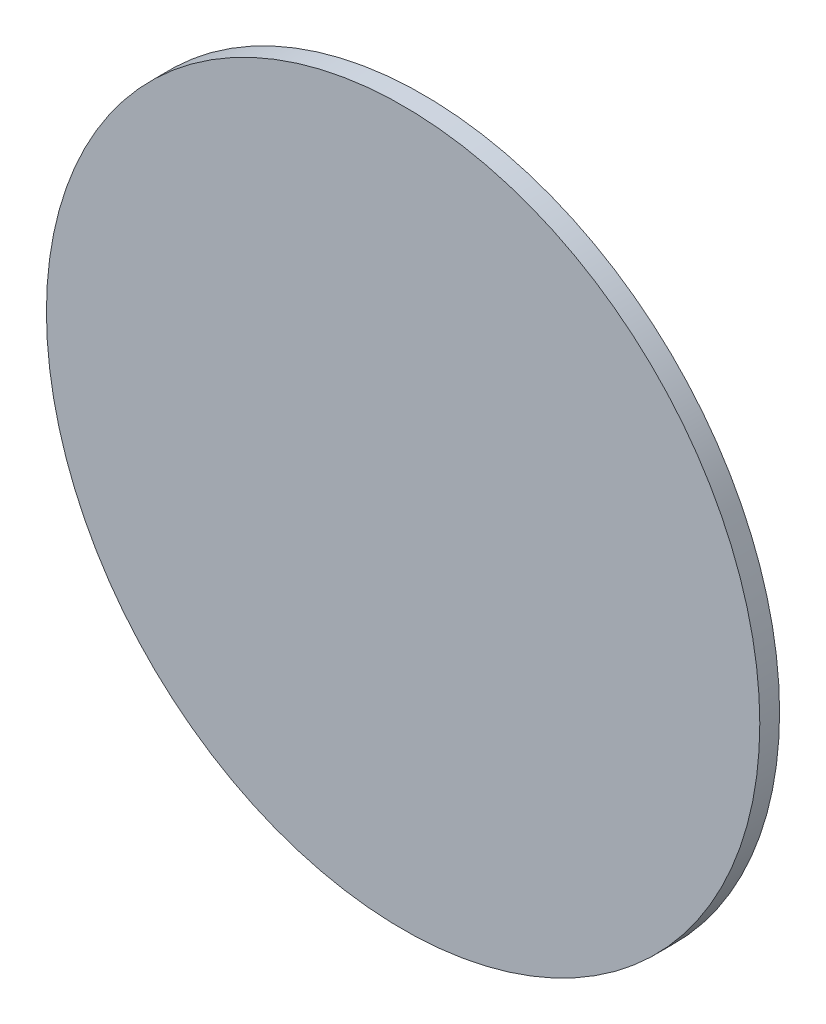
ISO-10303-21;
HEADER;
FILE_DESCRIPTION(('STEP AP214'),'2;1');
FILE_NAME('part.step','',(''),(''),'','','');
FILE_SCHEMA(('AUTOMOTIVE_DESIGN { 1 0 10303 214 1 1 1 1 }'));
ENDSEC;
DATA;
#1=APPLICATION_CONTEXT('core data for automotive mechanical design processes');
#2=APPLICATION_PROTOCOL_DEFINITION('international standard','automotive_design',2000,#1);
#3=PRODUCT_CONTEXT('',#1,'mechanical');
#4=PRODUCT('Part','Part','',(#3));
#5=PRODUCT_RELATED_PRODUCT_CATEGORY('part','',(#4));
#6=PRODUCT_DEFINITION_FORMATION('','',#4);
#7=PRODUCT_DEFINITION_CONTEXT('part definition',#1,'design');
#8=PRODUCT_DEFINITION('design','',#6,#7);
#9=PRODUCT_DEFINITION_SHAPE('','',#8);
#10=(LENGTH_UNIT() NAMED_UNIT(*) SI_UNIT(.MILLI.,.METRE.));
#11=(NAMED_UNIT(*) PLANE_ANGLE_UNIT() SI_UNIT($,.RADIAN.));
#12=(NAMED_UNIT(*) SI_UNIT($,.STERADIAN.) SOLID_ANGLE_UNIT());
#13=UNCERTAINTY_MEASURE_WITH_UNIT(LENGTH_MEASURE(1.E-05),#10,'distance_accuracy_value','');
#14=(GEOMETRIC_REPRESENTATION_CONTEXT(3) GLOBAL_UNCERTAINTY_ASSIGNED_CONTEXT((#13)) GLOBAL_UNIT_ASSIGNED_CONTEXT((#10,
#11,#12)) REPRESENTATION_CONTEXT('',''));
#15=CARTESIAN_POINT('',(0.,0.,0.));
#16=DIRECTION('',(0.,0.,1.));
#17=DIRECTION('',(1.,0.,0.));
#18=AXIS2_PLACEMENT_3D('',#15,#16,#17);
#19=CARTESIAN_POINT('',(0.,0.,7.4));
#20=DIRECTION('',(0.,0.,-1.));
#21=DIRECTION('',(-1.,0.,0.));
#22=AXIS2_PLACEMENT_3D('',#19,#20,#21);
#23=CYLINDRICAL_SURFACE('',#22,133.5);
#24=CARTESIAN_POINT('',(0.,0.,7.4));
#25=DIRECTION('',(0.,0.,1.));
#26=DIRECTION('',(1.,0.,0.));
#27=AXIS2_PLACEMENT_3D('',#24,#25,#26);
#28=CIRCLE('',#27,133.5);
#29=CARTESIAN_POINT('',(133.5,0.,7.4));
#30=VERTEX_POINT('',#29);
#31=EDGE_CURVE('E10',#30,#30,#28,.T.);
#32=ORIENTED_EDGE('',*,*,#31,.F.);
#33=EDGE_LOOP('',(#32));
#34=FACE_BOUND('',#33,.T.);
#35=CARTESIAN_POINT('',(0.,0.,0.));
#36=DIRECTION('',(0.,0.,1.));
#37=DIRECTION('',(1.,0.,0.));
#38=AXIS2_PLACEMENT_3D('',#35,#36,#37);
#39=CIRCLE('',#38,133.5);
#40=CARTESIAN_POINT('',(133.5,0.,0.));
#41=VERTEX_POINT('',#40);
#42=EDGE_CURVE('E35',#41,#41,#39,.T.);
#43=ORIENTED_EDGE('',*,*,#42,.T.);
#44=EDGE_LOOP('',(#43));
#45=FACE_BOUND('',#44,.T.);
#46=ADVANCED_FACE('F32',(#34,#45),#23,.T.);
#47=CARTESIAN_POINT('',(0.,0.,7.4));
#48=DIRECTION('',(0.,0.,1.));
#49=DIRECTION('',(1.,0.,0.));
#50=AXIS2_PLACEMENT_3D('',#47,#48,#49);
#51=PLANE('',#50);
#52=ORIENTED_EDGE('',*,*,#31,.T.);
#53=EDGE_LOOP('',(#52));
#54=FACE_BOUND('',#53,.T.);
#55=ADVANCED_FACE('F47',(#54),#51,.T.);
#56=CARTESIAN_POINT('',(0.,0.,0.));
#57=DIRECTION('',(0.,0.,1.));
#58=DIRECTION('',(1.,0.,0.));
#59=AXIS2_PLACEMENT_3D('',#56,#57,#58);
#60=PLANE('',#59);
#61=ORIENTED_EDGE('',*,*,#42,.F.);
#62=EDGE_LOOP('',(#61));
#63=FACE_BOUND('',#62,.T.);
#64=ADVANCED_FACE('F45',(#63),#60,.F.);
#65=CLOSED_SHELL('',(#46,#55,#64));
#66=MANIFOLD_SOLID_BREP('B2',#65);
#67=ADVANCED_BREP_SHAPE_REPRESENTATION('',(#18,#66),#14);
#68=SHAPE_DEFINITION_REPRESENTATION(#9,#67);
ENDSEC;
END-ISO-10303-21;
